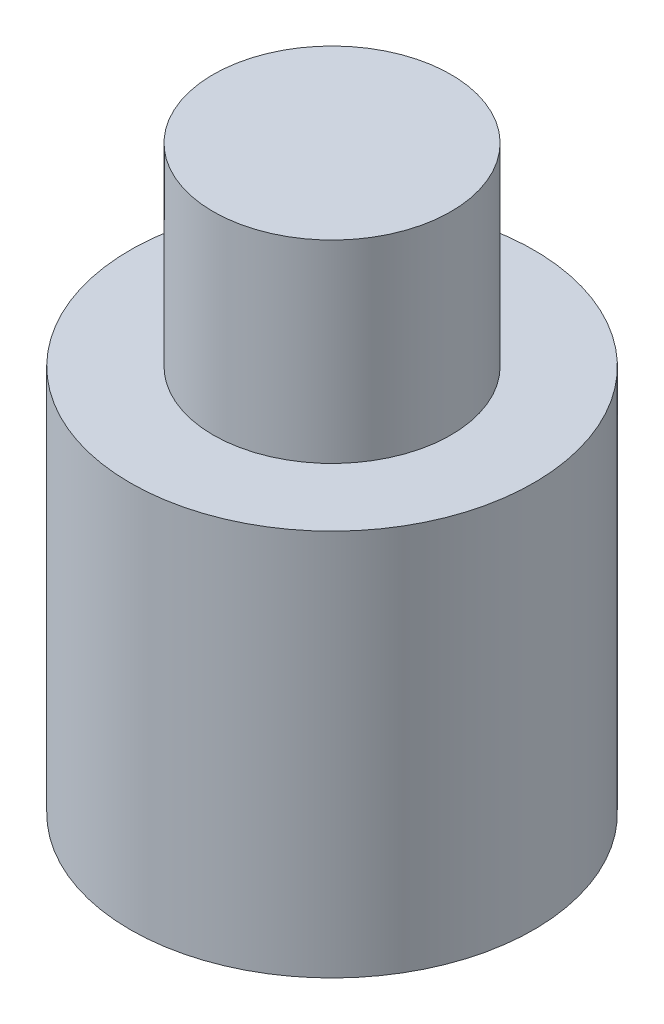
ISO-10303-21;
HEADER;
FILE_DESCRIPTION(('STEP AP214'),'2;1');
FILE_NAME('part.step','',(''),(''),'','','');
FILE_SCHEMA(('AUTOMOTIVE_DESIGN { 1 0 10303 214 1 1 1 1 }'));
ENDSEC;
DATA;
#1=APPLICATION_CONTEXT('core data for automotive mechanical design processes');
#2=APPLICATION_PROTOCOL_DEFINITION('international standard','automotive_design',2000,#1);
#3=PRODUCT_CONTEXT('',#1,'mechanical');
#4=PRODUCT('Part','Part','',(#3));
#5=PRODUCT_RELATED_PRODUCT_CATEGORY('part','',(#4));
#6=PRODUCT_DEFINITION_FORMATION('','',#4);
#7=PRODUCT_DEFINITION_CONTEXT('part definition',#1,'design');
#8=PRODUCT_DEFINITION('design','',#6,#7);
#9=PRODUCT_DEFINITION_SHAPE('','',#8);
#10=(LENGTH_UNIT() NAMED_UNIT(*) SI_UNIT(.MILLI.,.METRE.));
#11=(NAMED_UNIT(*) PLANE_ANGLE_UNIT() SI_UNIT($,.RADIAN.));
#12=(NAMED_UNIT(*) SI_UNIT($,.STERADIAN.) SOLID_ANGLE_UNIT());
#13=UNCERTAINTY_MEASURE_WITH_UNIT(LENGTH_MEASURE(1.E-05),#10,'distance_accuracy_value','');
#14=(GEOMETRIC_REPRESENTATION_CONTEXT(3) GLOBAL_UNCERTAINTY_ASSIGNED_CONTEXT((#13)) GLOBAL_UNIT_ASSIGNED_CONTEXT((#10,
#11,#12)) REPRESENTATION_CONTEXT('',''));
#15=CARTESIAN_POINT('',(0.,0.,0.));
#16=DIRECTION('',(0.,0.,1.));
#17=DIRECTION('',(1.,0.,0.));
#18=AXIS2_PLACEMENT_3D('',#15,#16,#17);
#19=CARTESIAN_POINT('',(0.,0.,0.));
#20=DIRECTION('',(0.,1.,0.));
#21=DIRECTION('',(0.,0.,1.));
#22=AXIS2_PLACEMENT_3D('',#19,#20,#21);
#23=PLANE('',#22);
#24=CARTESIAN_POINT('',(0.,0.,0.));
#25=DIRECTION('',(0.,1.,0.));
#26=DIRECTION('',(0.,0.,1.));
#27=AXIS2_PLACEMENT_3D('',#24,#25,#26);
#28=CIRCLE('',#27,3.65);
#29=CARTESIAN_POINT('',(0.,0.,3.65));
#30=VERTEX_POINT('',#29);
#31=EDGE_CURVE('E35',#30,#30,#28,.T.);
#32=ORIENTED_EDGE('',*,*,#31,.F.);
#33=EDGE_LOOP('',(#32));
#34=FACE_BOUND('',#33,.T.);
#35=CARTESIAN_POINT('',(0.,0.,0.));
#36=DIRECTION('',(0.,1.,0.));
#37=DIRECTION('',(0.,0.,1.));
#38=AXIS2_PLACEMENT_3D('',#35,#36,#37);
#39=CIRCLE('',#38,2.65);
#40=CARTESIAN_POINT('',(0.,0.,2.65));
#41=VERTEX_POINT('',#40);
#42=EDGE_CURVE('E43',#41,#41,#39,.T.);
#43=ORIENTED_EDGE('',*,*,#42,.T.);
#44=EDGE_LOOP('',(#43));
#45=FACE_BOUND('',#44,.T.);
#46=ADVANCED_FACE('F31',(#34,#45),#23,.F.);
#47=CARTESIAN_POINT('',(0.,3.5,0.));
#48=DIRECTION('',(0.,-1.,0.));
#49=DIRECTION('',(0.,0.,-1.));
#50=AXIS2_PLACEMENT_3D('',#47,#48,#49);
#51=CYLINDRICAL_SURFACE('',#50,3.65);
#52=ORIENTED_EDGE('',*,*,#31,.T.);
#53=EDGE_LOOP('',(#52));
#54=FACE_BOUND('',#53,.T.);
#55=CARTESIAN_POINT('',(0.,7.,0.));
#56=DIRECTION('',(0.,1.,0.));
#57=DIRECTION('',(0.,0.,1.));
#58=AXIS2_PLACEMENT_3D('',#55,#56,#57);
#59=CIRCLE('',#58,3.65);
#60=CARTESIAN_POINT('',(0.,7.,3.65));
#61=VERTEX_POINT('',#60);
#62=EDGE_CURVE('E47',#61,#61,#59,.T.);
#63=ORIENTED_EDGE('',*,*,#62,.F.);
#64=EDGE_LOOP('',(#63));
#65=FACE_BOUND('',#64,.T.);
#66=ADVANCED_FACE('F33',(#54,#65),#51,.T.);
#67=CARTESIAN_POINT('',(0.,3.5,0.));
#68=DIRECTION('',(0.,-1.,0.));
#69=DIRECTION('',(0.,0.,-1.));
#70=AXIS2_PLACEMENT_3D('',#67,#68,#69);
#71=CYLINDRICAL_SURFACE('',#70,2.65);
#72=CARTESIAN_POINT('',(0.,3.5,0.));
#73=DIRECTION('',(0.,1.,0.));
#74=DIRECTION('',(0.,0.,1.));
#75=AXIS2_PLACEMENT_3D('',#72,#73,#74);
#76=CIRCLE('',#75,2.65);
#77=CARTESIAN_POINT('',(0.,3.5,2.65));
#78=VERTEX_POINT('',#77);
#79=EDGE_CURVE('E50',#78,#78,#76,.T.);
#80=ORIENTED_EDGE('',*,*,#79,.T.);
#81=EDGE_LOOP('',(#80));
#82=FACE_BOUND('',#81,.T.);
#83=ORIENTED_EDGE('',*,*,#42,.F.);
#84=EDGE_LOOP('',(#83));
#85=FACE_BOUND('',#84,.T.);
#86=ADVANCED_FACE('F56',(#82,#85),#71,.F.);
#87=CARTESIAN_POINT('',(0.,3.5,0.));
#88=DIRECTION('',(0.,1.,0.));
#89=DIRECTION('',(0.,0.,1.));
#90=AXIS2_PLACEMENT_3D('',#87,#88,#89);
#91=PLANE('',#90);
#92=ORIENTED_EDGE('',*,*,#79,.F.);
#93=EDGE_LOOP('',(#92));
#94=FACE_BOUND('',#93,.T.);
#95=ADVANCED_FACE('F58',(#94),#91,.F.);
#96=CARTESIAN_POINT('',(0.,7.,0.));
#97=DIRECTION('',(0.,1.,0.));
#98=DIRECTION('',(0.,0.,1.));
#99=AXIS2_PLACEMENT_3D('',#96,#97,#98);
#100=PLANE('',#99);
#101=CARTESIAN_POINT('',(0.,7.,0.));
#102=DIRECTION('',(0.,1.,0.));
#103=DIRECTION('',(0.,0.,1.));
#104=AXIS2_PLACEMENT_3D('',#101,#102,#103);
#105=CIRCLE('',#104,2.15);
#106=CARTESIAN_POINT('',(0.,7.,2.15));
#107=VERTEX_POINT('',#106);
#108=EDGE_CURVE('E10',#107,#107,#105,.T.);
#109=ORIENTED_EDGE('',*,*,#108,.F.);
#110=EDGE_LOOP('',(#109));
#111=FACE_BOUND('',#110,.T.);
#112=ORIENTED_EDGE('',*,*,#62,.T.);
#113=EDGE_LOOP('',(#112));
#114=FACE_BOUND('',#113,.T.);
#115=ADVANCED_FACE('F65',(#111,#114),#100,.T.);
#116=CARTESIAN_POINT('',(0.,10.5,0.));
#117=DIRECTION('',(0.,-1.,0.));
#118=DIRECTION('',(0.,0.,-1.));
#119=AXIS2_PLACEMENT_3D('',#116,#117,#118);
#120=CYLINDRICAL_SURFACE('',#119,2.15);
#121=CARTESIAN_POINT('',(0.,10.5,0.));
#122=DIRECTION('',(0.,1.,0.));
#123=DIRECTION('',(0.,0.,1.));
#124=AXIS2_PLACEMENT_3D('',#121,#122,#123);
#125=CIRCLE('',#124,2.15);
#126=CARTESIAN_POINT('',(0.,10.5,2.15));
#127=VERTEX_POINT('',#126);
#128=EDGE_CURVE('E46',#127,#127,#125,.T.);
#129=ORIENTED_EDGE('',*,*,#128,.F.);
#130=EDGE_LOOP('',(#129));
#131=FACE_BOUND('',#130,.T.);
#132=ORIENTED_EDGE('',*,*,#108,.T.);
#133=EDGE_LOOP('',(#132));
#134=FACE_BOUND('',#133,.T.);
#135=ADVANCED_FACE('F78',(#131,#134),#120,.T.);
#136=CARTESIAN_POINT('',(0.,10.5,0.));
#137=DIRECTION('',(0.,1.,0.));
#138=DIRECTION('',(0.,0.,1.));
#139=AXIS2_PLACEMENT_3D('',#136,#137,#138);
#140=PLANE('',#139);
#141=ORIENTED_EDGE('',*,*,#128,.T.);
#142=EDGE_LOOP('',(#141));
#143=FACE_BOUND('',#142,.T.);
#144=ADVANCED_FACE('F84',(#143),#140,.T.);
#145=CLOSED_SHELL('',(#46,#66,#86,#95,#115,#135,#144));
#146=MANIFOLD_SOLID_BREP('B2',#145);
#147=ADVANCED_BREP_SHAPE_REPRESENTATION('',(#18,#146),#14);
#148=SHAPE_DEFINITION_REPRESENTATION(#9,#147);
ENDSEC;
END-ISO-10303-21;
